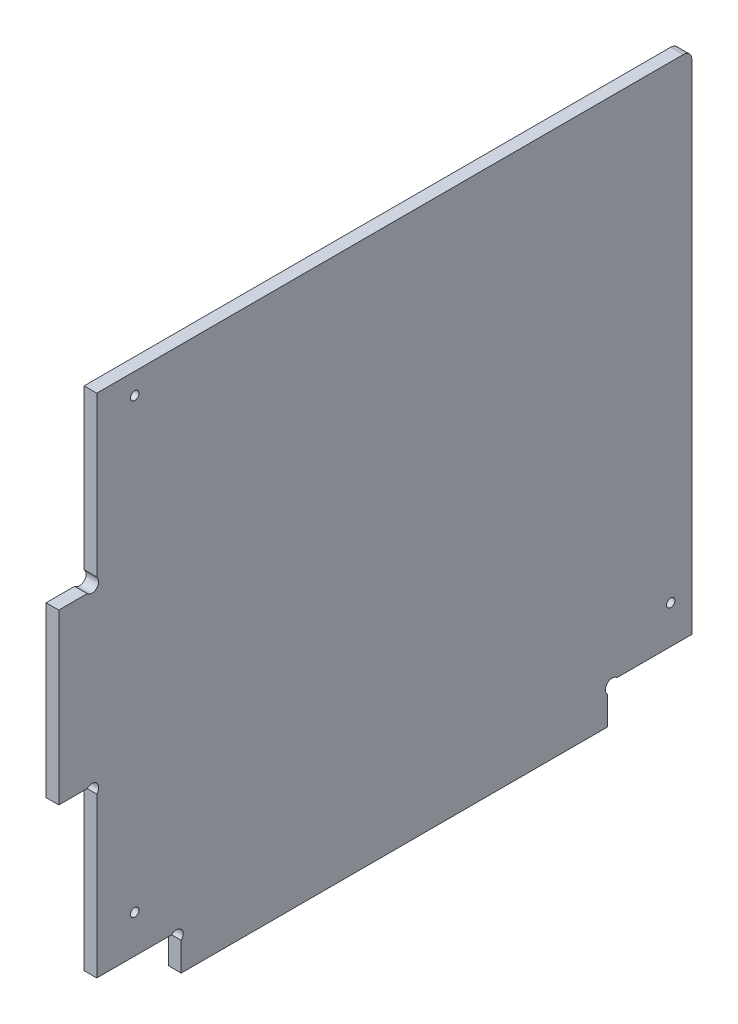
ISO-10303-21;
HEADER;
FILE_DESCRIPTION(('STEP AP214'),'2;1');
FILE_NAME('part.step','',(''),(''),'','','');
FILE_SCHEMA(('AUTOMOTIVE_DESIGN { 1 0 10303 214 1 1 1 1 }'));
ENDSEC;
DATA;
#1=APPLICATION_CONTEXT('core data for automotive mechanical design processes');
#2=APPLICATION_PROTOCOL_DEFINITION('international standard','automotive_design',2000,#1);
#3=PRODUCT_CONTEXT('',#1,'mechanical');
#4=PRODUCT('Part','Part','',(#3));
#5=PRODUCT_RELATED_PRODUCT_CATEGORY('part','',(#4));
#6=PRODUCT_DEFINITION_FORMATION('','',#4);
#7=PRODUCT_DEFINITION_CONTEXT('part definition',#1,'design');
#8=PRODUCT_DEFINITION('design','',#6,#7);
#9=PRODUCT_DEFINITION_SHAPE('','',#8);
#10=(LENGTH_UNIT() NAMED_UNIT(*) SI_UNIT(.MILLI.,.METRE.));
#11=(NAMED_UNIT(*) PLANE_ANGLE_UNIT() SI_UNIT($,.RADIAN.));
#12=(NAMED_UNIT(*) SI_UNIT($,.STERADIAN.) SOLID_ANGLE_UNIT());
#13=UNCERTAINTY_MEASURE_WITH_UNIT(LENGTH_MEASURE(1.E-05),#10,'distance_accuracy_value','');
#14=(GEOMETRIC_REPRESENTATION_CONTEXT(3) GLOBAL_UNCERTAINTY_ASSIGNED_CONTEXT((#13)) GLOBAL_UNIT_ASSIGNED_CONTEXT((#10,
#11,#12)) REPRESENTATION_CONTEXT('',''));
#15=CARTESIAN_POINT('',(0.,0.,0.));
#16=DIRECTION('',(0.,0.,1.));
#17=DIRECTION('',(1.,0.,0.));
#18=AXIS2_PLACEMENT_3D('',#15,#16,#17);
#19=CARTESIAN_POINT('',(3.,7.8686291501015,-131.131370849898));
#20=DIRECTION('',(-1.,0.,0.));
#21=DIRECTION('',(0.,0.,1.));
#22=AXIS2_PLACEMENT_3D('',#19,#20,#21);
#23=CYLINDRICAL_SURFACE('',#22,1.6);
#24=CARTESIAN_POINT('',(0.,7.8686291501015,-131.131370849898));
#25=DIRECTION('',(-1.,0.,0.));
#26=DIRECTION('',(0.,0.,-1.));
#27=AXIS2_PLACEMENT_3D('',#24,#25,#26);
#28=CIRCLE('',#27,1.6);
#29=CARTESIAN_POINT('',(0.,6.73725830020302,-130.));
#30=VERTEX_POINT('',#29);
#31=CARTESIAN_POINT('',(0.,9.,-132.262741699797));
#32=VERTEX_POINT('',#31);
#33=EDGE_CURVE('E176',#30,#32,#28,.T.);
#34=ORIENTED_EDGE('',*,*,#33,.T.);
#35=DIRECTION('',(-1.,0.,0.));
#36=VECTOR('',#35,1.);
#37=CARTESIAN_POINT('',(3.,9.,-132.262741699797));
#38=LINE('',#37,#36);
#39=CARTESIAN_POINT('',(3.,9.,-132.262741699797));
#40=VERTEX_POINT('',#39);
#41=EDGE_CURVE('E158',#40,#32,#38,.T.);
#42=ORIENTED_EDGE('',*,*,#41,.F.);
#43=CARTESIAN_POINT('',(3.,7.8686291501015,-131.131370849898));
#44=DIRECTION('',(-1.,0.,0.));
#45=DIRECTION('',(0.,0.,-1.));
#46=AXIS2_PLACEMENT_3D('',#43,#44,#45);
#47=CIRCLE('',#46,1.6);
#48=CARTESIAN_POINT('',(3.,6.73725830020302,-130.));
#49=VERTEX_POINT('',#48);
#50=EDGE_CURVE('E164',#49,#40,#47,.T.);
#51=ORIENTED_EDGE('',*,*,#50,.F.);
#52=DIRECTION('',(-1.,0.,0.));
#53=VECTOR('',#52,1.);
#54=CARTESIAN_POINT('',(3.,6.73725830020302,-130.));
#55=LINE('',#54,#53);
#56=EDGE_CURVE('E220',#49,#30,#55,.T.);
#57=ORIENTED_EDGE('',*,*,#56,.T.);
#58=EDGE_LOOP('',(#34,#42,#51,#57));
#59=FACE_BOUND('',#58,.T.);
#60=ADVANCED_FACE('F35',(#59),#23,.F.);
#61=CARTESIAN_POINT('',(3.,8.99999999999999,-150.));
#62=DIRECTION('',(0.,1.,0.));
#63=DIRECTION('',(0.,0.,1.));
#64=AXIS2_PLACEMENT_3D('',#61,#62,#63);
#65=PLANE('',#64);
#66=DIRECTION('',(0.,0.,-1.));
#67=VECTOR('',#66,1.);
#68=CARTESIAN_POINT('',(0.,8.99999999999999,-150.));
#69=LINE('',#68,#67);
#70=CARTESIAN_POINT('',(0.,8.99999999999999,-150.));
#71=VERTEX_POINT('',#70);
#72=EDGE_CURVE('E249',#32,#71,#69,.T.);
#73=ORIENTED_EDGE('',*,*,#72,.T.);
#74=DIRECTION('',(-1.,0.,0.));
#75=VECTOR('',#74,1.);
#76=CARTESIAN_POINT('',(3.,8.99999999999999,-150.));
#77=LINE('',#76,#75);
#78=CARTESIAN_POINT('',(3.,8.99999999999999,-150.));
#79=VERTEX_POINT('',#78);
#80=EDGE_CURVE('E161',#79,#71,#77,.T.);
#81=ORIENTED_EDGE('',*,*,#80,.F.);
#82=DIRECTION('',(0.,0.,-1.));
#83=VECTOR('',#82,1.);
#84=CARTESIAN_POINT('',(3.,8.99999999999999,-150.));
#85=LINE('',#84,#83);
#86=EDGE_CURVE('E154',#40,#79,#85,.T.);
#87=ORIENTED_EDGE('',*,*,#86,.F.);
#88=ORIENTED_EDGE('',*,*,#41,.T.);
#89=EDGE_LOOP('',(#73,#81,#87,#88));
#90=FACE_BOUND('',#89,.T.);
#91=ADVANCED_FACE('F156',(#90),#65,.F.);
#92=CARTESIAN_POINT('',(3.,129.,-150.));
#93=DIRECTION('',(0.,0.,1.));
#94=DIRECTION('',(0.,-1.,0.));
#95=AXIS2_PLACEMENT_3D('',#92,#93,#94);
#96=PLANE('',#95);
#97=DIRECTION('',(0.,1.,0.));
#98=VECTOR('',#97,1.);
#99=CARTESIAN_POINT('',(0.,129.,-150.));
#100=LINE('',#99,#98);
#101=CARTESIAN_POINT('',(0.,127.,-150.));
#102=VERTEX_POINT('',#101);
#103=EDGE_CURVE('E247',#71,#102,#100,.T.);
#104=ORIENTED_EDGE('',*,*,#103,.T.);
#105=DIRECTION('',(-1.,0.,0.));
#106=VECTOR('',#105,1.);
#107=CARTESIAN_POINT('',(3.,127.,-150.));
#108=LINE('',#107,#106);
#109=CARTESIAN_POINT('',(3.,127.,-150.));
#110=VERTEX_POINT('',#109);
#111=EDGE_CURVE('E43',#102,#110,#108,.F.);
#112=ORIENTED_EDGE('',*,*,#111,.T.);
#113=DIRECTION('',(0.,1.,0.));
#114=VECTOR('',#113,1.);
#115=CARTESIAN_POINT('',(3.,129.,-150.));
#116=LINE('',#115,#114);
#117=EDGE_CURVE('E163',#79,#110,#116,.T.);
#118=ORIENTED_EDGE('',*,*,#117,.F.);
#119=ORIENTED_EDGE('',*,*,#80,.T.);
#120=EDGE_LOOP('',(#104,#112,#118,#119));
#121=FACE_BOUND('',#120,.T.);
#122=ADVANCED_FACE('F331',(#121),#96,.F.);
#123=CARTESIAN_POINT('',(3.,129.,-8.99999999999997));
#124=DIRECTION('',(0.,-1.,0.));
#125=DIRECTION('',(0.,0.,-1.));
#126=AXIS2_PLACEMENT_3D('',#123,#124,#125);
#127=PLANE('',#126);
#128=DIRECTION('',(0.,0.,1.));
#129=VECTOR('',#128,1.);
#130=CARTESIAN_POINT('',(3.,129.,-8.99999999999997));
#131=LINE('',#130,#129);
#132=CARTESIAN_POINT('',(3.,129.,-148.));
#133=VERTEX_POINT('',#132);
#134=CARTESIAN_POINT('',(3.,129.,-8.99999999999997));
#135=VERTEX_POINT('',#134);
#136=EDGE_CURVE('E276',#133,#135,#131,.T.);
#137=ORIENTED_EDGE('',*,*,#136,.F.);
#138=DIRECTION('',(-1.,0.,0.));
#139=VECTOR('',#138,1.);
#140=CARTESIAN_POINT('',(3.,129.,-148.));
#141=LINE('',#140,#139);
#142=CARTESIAN_POINT('',(0.,129.,-148.));
#143=VERTEX_POINT('',#142);
#144=EDGE_CURVE('E177',#133,#143,#141,.T.);
#145=ORIENTED_EDGE('',*,*,#144,.T.);
#146=DIRECTION('',(0.,0.,1.));
#147=VECTOR('',#146,1.);
#148=CARTESIAN_POINT('',(0.,129.,-8.99999999999997));
#149=LINE('',#148,#147);
#150=CARTESIAN_POINT('',(0.,129.,-8.99999999999997));
#151=VERTEX_POINT('',#150);
#152=EDGE_CURVE('E245',#143,#151,#149,.T.);
#153=ORIENTED_EDGE('',*,*,#152,.T.);
#154=DIRECTION('',(-1.,0.,0.));
#155=VECTOR('',#154,1.);
#156=CARTESIAN_POINT('',(3.,129.,-8.99999999999997));
#157=LINE('',#156,#155);
#158=EDGE_CURVE('E181',#135,#151,#157,.T.);
#159=ORIENTED_EDGE('',*,*,#158,.F.);
#160=EDGE_LOOP('',(#137,#145,#153,#159));
#161=FACE_BOUND('',#160,.T.);
#162=ADVANCED_FACE('F336',(#161),#127,.F.);
#163=CARTESIAN_POINT('',(3.,91.2627416997969,-8.99999999999998));
#164=DIRECTION('',(0.,0.,-1.));
#165=DIRECTION('',(0.,1.,0.));
#166=AXIS2_PLACEMENT_3D('',#163,#164,#165);
#167=PLANE('',#166);
#168=DIRECTION('',(0.,-1.,0.));
#169=VECTOR('',#168,1.);
#170=CARTESIAN_POINT('',(0.,91.2627416997969,-8.99999999999998));
#171=LINE('',#170,#169);
#172=CARTESIAN_POINT('',(0.,91.2627416997969,-8.99999999999998));
#173=VERTEX_POINT('',#172);
#174=EDGE_CURVE('E243',#151,#173,#171,.T.);
#175=ORIENTED_EDGE('',*,*,#174,.T.);
#176=DIRECTION('',(-1.,0.,0.));
#177=VECTOR('',#176,1.);
#178=CARTESIAN_POINT('',(3.,91.2627416997969,-8.99999999999998));
#179=LINE('',#178,#177);
#180=CARTESIAN_POINT('',(3.,91.2627416997969,-8.99999999999998));
#181=VERTEX_POINT('',#180);
#182=EDGE_CURVE('E187',#181,#173,#179,.T.);
#183=ORIENTED_EDGE('',*,*,#182,.F.);
#184=DIRECTION('',(0.,-1.,0.));
#185=VECTOR('',#184,1.);
#186=CARTESIAN_POINT('',(3.,91.2627416997969,-8.99999999999998));
#187=LINE('',#186,#185);
#188=EDGE_CURVE('E274',#135,#181,#187,.T.);
#189=ORIENTED_EDGE('',*,*,#188,.F.);
#190=ORIENTED_EDGE('',*,*,#158,.T.);
#191=EDGE_LOOP('',(#175,#183,#189,#190));
#192=FACE_BOUND('',#191,.T.);
#193=ADVANCED_FACE('F339',(#192),#167,.F.);
#194=CARTESIAN_POINT('',(3.,90.1313708498985,-7.86862915010151));
#195=DIRECTION('',(-1.,0.,0.));
#196=DIRECTION('',(0.,0.,1.));
#197=AXIS2_PLACEMENT_3D('',#194,#195,#196);
#198=CYLINDRICAL_SURFACE('',#197,1.6);
#199=CARTESIAN_POINT('',(0.,90.1313708498985,-7.86862915010151));
#200=DIRECTION('',(-1.,0.,0.));
#201=DIRECTION('',(0.,0.,1.));
#202=AXIS2_PLACEMENT_3D('',#199,#200,#201);
#203=CIRCLE('',#202,1.6);
#204=CARTESIAN_POINT('',(0.,89.,-6.73725830020303));
#205=VERTEX_POINT('',#204);
#206=EDGE_CURVE('E241',#173,#205,#203,.T.);
#207=ORIENTED_EDGE('',*,*,#206,.T.);
#208=DIRECTION('',(-1.,0.,0.));
#209=VECTOR('',#208,1.);
#210=CARTESIAN_POINT('',(3.,89.,-6.73725830020303));
#211=LINE('',#210,#209);
#212=CARTESIAN_POINT('',(3.,89.,-6.73725830020303));
#213=VERTEX_POINT('',#212);
#214=EDGE_CURVE('E190',#213,#205,#211,.T.);
#215=ORIENTED_EDGE('',*,*,#214,.F.);
#216=CARTESIAN_POINT('',(3.,90.1313708498985,-7.86862915010151));
#217=DIRECTION('',(-1.,0.,0.));
#218=DIRECTION('',(0.,0.,1.));
#219=AXIS2_PLACEMENT_3D('',#216,#217,#218);
#220=CIRCLE('',#219,1.6);
#221=EDGE_CURVE('E272',#181,#213,#220,.T.);
#222=ORIENTED_EDGE('',*,*,#221,.F.);
#223=ORIENTED_EDGE('',*,*,#182,.T.);
#224=EDGE_LOOP('',(#207,#215,#222,#223));
#225=FACE_BOUND('',#224,.T.);
#226=ADVANCED_FACE('F343',(#225),#198,.F.);
#227=CARTESIAN_POINT('',(3.,89.,0.));
#228=DIRECTION('',(0.,-1.,0.));
#229=DIRECTION('',(0.,0.,-1.));
#230=AXIS2_PLACEMENT_3D('',#227,#228,#229);
#231=PLANE('',#230);
#232=DIRECTION('',(0.,0.,1.));
#233=VECTOR('',#232,1.);
#234=CARTESIAN_POINT('',(0.,89.,0.));
#235=LINE('',#234,#233);
#236=CARTESIAN_POINT('',(0.,89.,0.));
#237=VERTEX_POINT('',#236);
#238=EDGE_CURVE('E239',#205,#237,#235,.T.);
#239=ORIENTED_EDGE('',*,*,#238,.T.);
#240=DIRECTION('',(-1.,0.,0.));
#241=VECTOR('',#240,1.);
#242=CARTESIAN_POINT('',(3.,89.,0.));
#243=LINE('',#242,#241);
#244=CARTESIAN_POINT('',(3.,89.,0.));
#245=VERTEX_POINT('',#244);
#246=EDGE_CURVE('E193',#245,#237,#243,.T.);
#247=ORIENTED_EDGE('',*,*,#246,.F.);
#248=DIRECTION('',(0.,0.,1.));
#249=VECTOR('',#248,1.);
#250=CARTESIAN_POINT('',(3.,89.,0.));
#251=LINE('',#250,#249);
#252=EDGE_CURVE('E270',#213,#245,#251,.T.);
#253=ORIENTED_EDGE('',*,*,#252,.F.);
#254=ORIENTED_EDGE('',*,*,#214,.T.);
#255=EDGE_LOOP('',(#239,#247,#253,#254));
#256=FACE_BOUND('',#255,.T.);
#257=ADVANCED_FACE('F347',(#256),#231,.F.);
#258=CARTESIAN_POINT('',(3.,49.,0.));
#259=DIRECTION('',(0.,0.,-1.));
#260=DIRECTION('',(-1.,0.,0.));
#261=AXIS2_PLACEMENT_3D('',#258,#259,#260);
#262=PLANE('',#261);
#263=DIRECTION('',(0.,-1.,0.));
#264=VECTOR('',#263,1.);
#265=CARTESIAN_POINT('',(0.,49.,0.));
#266=LINE('',#265,#264);
#267=CARTESIAN_POINT('',(0.,49.,0.));
#268=VERTEX_POINT('',#267);
#269=EDGE_CURVE('E237',#237,#268,#266,.T.);
#270=ORIENTED_EDGE('',*,*,#269,.T.);
#271=DIRECTION('',(-1.,0.,0.));
#272=VECTOR('',#271,1.);
#273=CARTESIAN_POINT('',(3.,49.,0.));
#274=LINE('',#273,#272);
#275=CARTESIAN_POINT('',(3.,49.,0.));
#276=VERTEX_POINT('',#275);
#277=EDGE_CURVE('E196',#276,#268,#274,.T.);
#278=ORIENTED_EDGE('',*,*,#277,.F.);
#279=DIRECTION('',(0.,-1.,0.));
#280=VECTOR('',#279,1.);
#281=CARTESIAN_POINT('',(3.,49.,0.));
#282=LINE('',#281,#280);
#283=EDGE_CURVE('E268',#245,#276,#282,.T.);
#284=ORIENTED_EDGE('',*,*,#283,.F.);
#285=ORIENTED_EDGE('',*,*,#246,.T.);
#286=EDGE_LOOP('',(#270,#278,#284,#285));
#287=FACE_BOUND('',#286,.T.);
#288=ADVANCED_FACE('F351',(#287),#262,.F.);
#289=CARTESIAN_POINT('',(3.,49.,0.));
#290=DIRECTION('',(0.,1.,0.));
#291=DIRECTION('',(0.,0.,1.));
#292=AXIS2_PLACEMENT_3D('',#289,#290,#291);
#293=PLANE('',#292);
#294=DIRECTION('',(0.,0.,-1.));
#295=VECTOR('',#294,1.);
#296=CARTESIAN_POINT('',(0.,49.,0.));
#297=LINE('',#296,#295);
#298=CARTESIAN_POINT('',(0.,49.,-6.73725830020302));
#299=VERTEX_POINT('',#298);
#300=EDGE_CURVE('E235',#268,#299,#297,.T.);
#301=ORIENTED_EDGE('',*,*,#300,.T.);
#302=DIRECTION('',(-1.,0.,0.));
#303=VECTOR('',#302,1.);
#304=CARTESIAN_POINT('',(3.,49.,-6.73725830020302));
#305=LINE('',#304,#303);
#306=CARTESIAN_POINT('',(3.,49.,-6.73725830020302));
#307=VERTEX_POINT('',#306);
#308=EDGE_CURVE('E199',#307,#299,#305,.T.);
#309=ORIENTED_EDGE('',*,*,#308,.F.);
#310=DIRECTION('',(0.,0.,-1.));
#311=VECTOR('',#310,1.);
#312=CARTESIAN_POINT('',(3.,49.,0.));
#313=LINE('',#312,#311);
#314=EDGE_CURVE('E266',#276,#307,#313,.T.);
#315=ORIENTED_EDGE('',*,*,#314,.F.);
#316=ORIENTED_EDGE('',*,*,#277,.T.);
#317=EDGE_LOOP('',(#301,#309,#315,#316));
#318=FACE_BOUND('',#317,.T.);
#319=ADVANCED_FACE('F355',(#318),#293,.F.);
#320=CARTESIAN_POINT('',(3.,47.8686291501015,-7.86862915010151));
#321=DIRECTION('',(-1.,0.,0.));
#322=DIRECTION('',(0.,0.,1.));
#323=AXIS2_PLACEMENT_3D('',#320,#321,#322);
#324=CYLINDRICAL_SURFACE('',#323,1.6);
#325=CARTESIAN_POINT('',(0.,47.8686291501015,-7.86862915010151));
#326=DIRECTION('',(-1.,0.,0.));
#327=DIRECTION('',(0.,0.,-1.));
#328=AXIS2_PLACEMENT_3D('',#325,#326,#327);
#329=CIRCLE('',#328,1.6);
#330=CARTESIAN_POINT('',(0.,46.7372583002031,-8.99999999999999));
#331=VERTEX_POINT('',#330);
#332=EDGE_CURVE('E233',#299,#331,#329,.T.);
#333=ORIENTED_EDGE('',*,*,#332,.T.);
#334=DIRECTION('',(-1.,0.,0.));
#335=VECTOR('',#334,1.);
#336=CARTESIAN_POINT('',(3.,46.7372583002031,-8.99999999999999));
#337=LINE('',#336,#335);
#338=CARTESIAN_POINT('',(3.,46.7372583002031,-8.99999999999999));
#339=VERTEX_POINT('',#338);
#340=EDGE_CURVE('E202',#339,#331,#337,.T.);
#341=ORIENTED_EDGE('',*,*,#340,.F.);
#342=CARTESIAN_POINT('',(3.,47.8686291501015,-7.86862915010151));
#343=DIRECTION('',(-1.,0.,0.));
#344=DIRECTION('',(0.,0.,-1.));
#345=AXIS2_PLACEMENT_3D('',#342,#343,#344);
#346=CIRCLE('',#345,1.6);
#347=EDGE_CURVE('E264',#307,#339,#346,.T.);
#348=ORIENTED_EDGE('',*,*,#347,.F.);
#349=ORIENTED_EDGE('',*,*,#308,.T.);
#350=EDGE_LOOP('',(#333,#341,#348,#349));
#351=FACE_BOUND('',#350,.T.);
#352=ADVANCED_FACE('F359',(#351),#324,.F.);
#353=CARTESIAN_POINT('',(3.,8.99999999999998,-9.));
#354=DIRECTION('',(0.,0.,-1.));
#355=DIRECTION('',(0.,1.,0.));
#356=AXIS2_PLACEMENT_3D('',#353,#354,#355);
#357=PLANE('',#356);
#358=DIRECTION('',(0.,-1.,0.));
#359=VECTOR('',#358,1.);
#360=CARTESIAN_POINT('',(0.,8.99999999999998,-9.));
#361=LINE('',#360,#359);
#362=CARTESIAN_POINT('',(0.,8.99999999999998,-9.));
#363=VERTEX_POINT('',#362);
#364=EDGE_CURVE('E231',#331,#363,#361,.T.);
#365=ORIENTED_EDGE('',*,*,#364,.T.);
#366=DIRECTION('',(-1.,0.,0.));
#367=VECTOR('',#366,1.);
#368=CARTESIAN_POINT('',(3.,8.99999999999998,-9.));
#369=LINE('',#368,#367);
#370=CARTESIAN_POINT('',(3.,8.99999999999998,-9.));
#371=VERTEX_POINT('',#370);
#372=EDGE_CURVE('E205',#371,#363,#369,.T.);
#373=ORIENTED_EDGE('',*,*,#372,.F.);
#374=DIRECTION('',(0.,-1.,0.));
#375=VECTOR('',#374,1.);
#376=CARTESIAN_POINT('',(3.,8.99999999999998,-9.));
#377=LINE('',#376,#375);
#378=EDGE_CURVE('E262',#339,#371,#377,.T.);
#379=ORIENTED_EDGE('',*,*,#378,.F.);
#380=ORIENTED_EDGE('',*,*,#340,.T.);
#381=EDGE_LOOP('',(#365,#373,#379,#380));
#382=FACE_BOUND('',#381,.T.);
#383=ADVANCED_FACE('F363',(#382),#357,.F.);
#384=CARTESIAN_POINT('',(3.,8.99999999999998,-26.737258300203));
#385=DIRECTION('',(0.,1.,0.));
#386=DIRECTION('',(0.,0.,1.));
#387=AXIS2_PLACEMENT_3D('',#384,#385,#386);
#388=PLANE('',#387);
#389=DIRECTION('',(0.,0.,-1.));
#390=VECTOR('',#389,1.);
#391=CARTESIAN_POINT('',(0.,8.99999999999998,-26.737258300203));
#392=LINE('',#391,#390);
#393=CARTESIAN_POINT('',(0.,8.99999999999998,-26.737258300203));
#394=VERTEX_POINT('',#393);
#395=EDGE_CURVE('E229',#363,#394,#392,.T.);
#396=ORIENTED_EDGE('',*,*,#395,.T.);
#397=DIRECTION('',(-1.,0.,0.));
#398=VECTOR('',#397,1.);
#399=CARTESIAN_POINT('',(3.,8.99999999999998,-26.737258300203));
#400=LINE('',#399,#398);
#401=CARTESIAN_POINT('',(3.,8.99999999999998,-26.737258300203));
#402=VERTEX_POINT('',#401);
#403=EDGE_CURVE('E208',#402,#394,#400,.T.);
#404=ORIENTED_EDGE('',*,*,#403,.F.);
#405=DIRECTION('',(0.,0.,-1.));
#406=VECTOR('',#405,1.);
#407=CARTESIAN_POINT('',(3.,8.99999999999998,-26.737258300203));
#408=LINE('',#407,#406);
#409=EDGE_CURVE('E260',#371,#402,#408,.T.);
#410=ORIENTED_EDGE('',*,*,#409,.F.);
#411=ORIENTED_EDGE('',*,*,#372,.T.);
#412=EDGE_LOOP('',(#396,#404,#410,#411));
#413=FACE_BOUND('',#412,.T.);
#414=ADVANCED_FACE('F367',(#413),#388,.F.);
#415=CARTESIAN_POINT('',(3.,7.8686291501015,-27.8686291501015));
#416=DIRECTION('',(-1.,0.,0.));
#417=DIRECTION('',(0.,0.,1.));
#418=AXIS2_PLACEMENT_3D('',#415,#416,#417);
#419=CYLINDRICAL_SURFACE('',#418,1.6);
#420=CARTESIAN_POINT('',(0.,7.8686291501015,-27.8686291501015));
#421=DIRECTION('',(-1.,0.,0.));
#422=DIRECTION('',(0.,0.,1.));
#423=AXIS2_PLACEMENT_3D('',#420,#421,#422);
#424=CIRCLE('',#423,1.6);
#425=CARTESIAN_POINT('',(0.,6.73725830020306,-29.));
#426=VERTEX_POINT('',#425);
#427=EDGE_CURVE('E227',#394,#426,#424,.T.);
#428=ORIENTED_EDGE('',*,*,#427,.T.);
#429=DIRECTION('',(-1.,0.,0.));
#430=VECTOR('',#429,1.);
#431=CARTESIAN_POINT('',(3.,6.73725830020306,-29.));
#432=LINE('',#431,#430);
#433=CARTESIAN_POINT('',(3.,6.73725830020306,-29.));
#434=VERTEX_POINT('',#433);
#435=EDGE_CURVE('E211',#434,#426,#432,.T.);
#436=ORIENTED_EDGE('',*,*,#435,.F.);
#437=CARTESIAN_POINT('',(3.,7.8686291501015,-27.8686291501015));
#438=DIRECTION('',(-1.,0.,0.));
#439=DIRECTION('',(0.,0.,1.));
#440=AXIS2_PLACEMENT_3D('',#437,#438,#439);
#441=CIRCLE('',#440,1.6);
#442=EDGE_CURVE('E258',#402,#434,#441,.T.);
#443=ORIENTED_EDGE('',*,*,#442,.F.);
#444=ORIENTED_EDGE('',*,*,#403,.T.);
#445=EDGE_LOOP('',(#428,#436,#443,#444));
#446=FACE_BOUND('',#445,.T.);
#447=ADVANCED_FACE('F371',(#446),#419,.F.);
#448=CARTESIAN_POINT('',(3.,6.73725830020306,-29.));
#449=DIRECTION('',(0.,0.,-1.));
#450=DIRECTION('',(0.,1.,0.));
#451=AXIS2_PLACEMENT_3D('',#448,#449,#450);
#452=PLANE('',#451);
#453=DIRECTION('',(0.,-1.,0.));
#454=VECTOR('',#453,1.);
#455=CARTESIAN_POINT('',(0.,6.73725830020306,-29.));
#456=LINE('',#455,#454);
#457=CARTESIAN_POINT('',(0.,0.,-29.));
#458=VERTEX_POINT('',#457);
#459=EDGE_CURVE('E225',#426,#458,#456,.T.);
#460=ORIENTED_EDGE('',*,*,#459,.T.);
#461=DIRECTION('',(-1.,0.,0.));
#462=VECTOR('',#461,1.);
#463=CARTESIAN_POINT('',(3.,0.,-29.));
#464=LINE('',#463,#462);
#465=CARTESIAN_POINT('',(3.,0.,-29.));
#466=VERTEX_POINT('',#465);
#467=EDGE_CURVE('E214',#466,#458,#464,.T.);
#468=ORIENTED_EDGE('',*,*,#467,.F.);
#469=DIRECTION('',(0.,-1.,0.));
#470=VECTOR('',#469,1.);
#471=CARTESIAN_POINT('',(3.,6.73725830020306,-29.));
#472=LINE('',#471,#470);
#473=EDGE_CURVE('E256',#434,#466,#472,.T.);
#474=ORIENTED_EDGE('',*,*,#473,.F.);
#475=ORIENTED_EDGE('',*,*,#435,.T.);
#476=EDGE_LOOP('',(#460,#468,#474,#475));
#477=FACE_BOUND('',#476,.T.);
#478=ADVANCED_FACE('F375',(#477),#452,.F.);
#479=CARTESIAN_POINT('',(3.,0.,-29.));
#480=DIRECTION('',(0.,1.,0.));
#481=DIRECTION('',(0.,0.,1.));
#482=AXIS2_PLACEMENT_3D('',#479,#480,#481);
#483=PLANE('',#482);
#484=DIRECTION('',(0.,0.,-1.));
#485=VECTOR('',#484,1.);
#486=CARTESIAN_POINT('',(0.,0.,-29.));
#487=LINE('',#486,#485);
#488=CARTESIAN_POINT('',(0.,0.,-130.));
#489=VERTEX_POINT('',#488);
#490=EDGE_CURVE('E223',#458,#489,#487,.T.);
#491=ORIENTED_EDGE('',*,*,#490,.T.);
#492=DIRECTION('',(-1.,0.,0.));
#493=VECTOR('',#492,1.);
#494=CARTESIAN_POINT('',(3.,0.,-130.));
#495=LINE('',#494,#493);
#496=CARTESIAN_POINT('',(3.,0.,-130.));
#497=VERTEX_POINT('',#496);
#498=EDGE_CURVE('E217',#497,#489,#495,.T.);
#499=ORIENTED_EDGE('',*,*,#498,.F.);
#500=DIRECTION('',(0.,0.,-1.));
#501=VECTOR('',#500,1.);
#502=CARTESIAN_POINT('',(3.,0.,-29.));
#503=LINE('',#502,#501);
#504=EDGE_CURVE('E254',#466,#497,#503,.T.);
#505=ORIENTED_EDGE('',*,*,#504,.F.);
#506=ORIENTED_EDGE('',*,*,#467,.T.);
#507=EDGE_LOOP('',(#491,#499,#505,#506));
#508=FACE_BOUND('',#507,.T.);
#509=ADVANCED_FACE('F379',(#508),#483,.F.);
#510=CARTESIAN_POINT('',(3.,6.73725830020302,-130.));
#511=DIRECTION('',(0.,0.,1.));
#512=DIRECTION('',(0.,-1.,0.));
#513=AXIS2_PLACEMENT_3D('',#510,#511,#512);
#514=PLANE('',#513);
#515=DIRECTION('',(0.,1.,0.));
#516=VECTOR('',#515,1.);
#517=CARTESIAN_POINT('',(0.,6.73725830020302,-130.));
#518=LINE('',#517,#516);
#519=EDGE_CURVE('E173',#489,#30,#518,.T.);
#520=ORIENTED_EDGE('',*,*,#519,.T.);
#521=ORIENTED_EDGE('',*,*,#56,.F.);
#522=DIRECTION('',(0.,1.,0.));
#523=VECTOR('',#522,1.);
#524=CARTESIAN_POINT('',(3.,6.73725830020302,-130.));
#525=LINE('',#524,#523);
#526=EDGE_CURVE('E169',#497,#49,#525,.T.);
#527=ORIENTED_EDGE('',*,*,#526,.F.);
#528=ORIENTED_EDGE('',*,*,#498,.T.);
#529=EDGE_LOOP('',(#520,#521,#527,#528));
#530=FACE_BOUND('',#529,.T.);
#531=ADVANCED_FACE('F309',(#530),#514,.F.);
#532=CARTESIAN_POINT('',(3.,7.8686291501015,-131.131370849898));
#533=DIRECTION('',(1.,0.,0.));
#534=DIRECTION('',(0.,0.,-1.));
#535=AXIS2_PLACEMENT_3D('',#532,#533,#534);
#536=PLANE('',#535);
#537=CARTESIAN_POINT('',(3.,124.,-18.));
#538=DIRECTION('',(1.,0.,0.));
#539=DIRECTION('',(0.,0.,-1.));
#540=AXIS2_PLACEMENT_3D('',#537,#538,#539);
#541=CIRCLE('',#540,0.999999999999998);
#542=CARTESIAN_POINT('',(3.,124.,-19.));
#543=VERTEX_POINT('',#542);
#544=EDGE_CURVE('E291',#543,#543,#541,.T.);
#545=ORIENTED_EDGE('',*,*,#544,.F.);
#546=EDGE_LOOP('',(#545));
#547=FACE_BOUND('',#546,.T.);
#548=CARTESIAN_POINT('',(3.,18.,-18.));
#549=DIRECTION('',(1.,0.,0.));
#550=DIRECTION('',(0.,0.,-1.));
#551=AXIS2_PLACEMENT_3D('',#548,#549,#550);
#552=CIRCLE('',#551,1.00000000000001);
#553=CARTESIAN_POINT('',(3.,18.,-19.));
#554=VERTEX_POINT('',#553);
#555=EDGE_CURVE('E285',#554,#554,#552,.T.);
#556=ORIENTED_EDGE('',*,*,#555,.F.);
#557=EDGE_LOOP('',(#556));
#558=FACE_BOUND('',#557,.T.);
#559=CARTESIAN_POINT('',(3.,18.,-145.));
#560=DIRECTION('',(1.,0.,0.));
#561=DIRECTION('',(0.,0.,-1.));
#562=AXIS2_PLACEMENT_3D('',#559,#560,#561);
#563=CIRCLE('',#562,0.999999999999998);
#564=CARTESIAN_POINT('',(3.,18.,-146.));
#565=VERTEX_POINT('',#564);
#566=EDGE_CURVE('E279',#565,#565,#563,.T.);
#567=ORIENTED_EDGE('',*,*,#566,.F.);
#568=EDGE_LOOP('',(#567));
#569=FACE_BOUND('',#568,.T.);
#570=ORIENTED_EDGE('',*,*,#117,.T.);
#571=CARTESIAN_POINT('',(3.,127.,-148.));
#572=DIRECTION('',(1.,0.,0.));
#573=DIRECTION('',(0.,0.,-1.));
#574=AXIS2_PLACEMENT_3D('',#571,#572,#573);
#575=CIRCLE('',#574,2.);
#576=EDGE_CURVE('E11',#110,#133,#575,.T.);
#577=ORIENTED_EDGE('',*,*,#576,.T.);
#578=ORIENTED_EDGE('',*,*,#136,.T.);
#579=ORIENTED_EDGE('',*,*,#188,.T.);
#580=ORIENTED_EDGE('',*,*,#221,.T.);
#581=ORIENTED_EDGE('',*,*,#252,.T.);
#582=ORIENTED_EDGE('',*,*,#283,.T.);
#583=ORIENTED_EDGE('',*,*,#314,.T.);
#584=ORIENTED_EDGE('',*,*,#347,.T.);
#585=ORIENTED_EDGE('',*,*,#378,.T.);
#586=ORIENTED_EDGE('',*,*,#409,.T.);
#587=ORIENTED_EDGE('',*,*,#442,.T.);
#588=ORIENTED_EDGE('',*,*,#473,.T.);
#589=ORIENTED_EDGE('',*,*,#504,.T.);
#590=ORIENTED_EDGE('',*,*,#526,.T.);
#591=ORIENTED_EDGE('',*,*,#50,.T.);
#592=ORIENTED_EDGE('',*,*,#86,.T.);
#593=EDGE_LOOP('',(#570,#577,#578,#579,#580,#581,#582,#583,#584,#585,#586,#587,#588,#589,#590,
#591,#592));
#594=FACE_BOUND('',#593,.T.);
#595=ADVANCED_FACE('F167',(#547,#558,#569,#594),#536,.T.);
#596=CARTESIAN_POINT('',(0.,7.8686291501015,-131.131370849898));
#597=DIRECTION('',(1.,0.,0.));
#598=DIRECTION('',(0.,0.,-1.));
#599=AXIS2_PLACEMENT_3D('',#596,#597,#598);
#600=PLANE('',#599);
#601=CARTESIAN_POINT('',(0.,124.,-18.));
#602=DIRECTION('',(1.,0.,0.));
#603=DIRECTION('',(0.,0.,-1.));
#604=AXIS2_PLACEMENT_3D('',#601,#602,#603);
#605=CIRCLE('',#604,0.999999999999998);
#606=CARTESIAN_POINT('',(0.,124.,-19.));
#607=VERTEX_POINT('',#606);
#608=EDGE_CURVE('E252',#607,#607,#605,.T.);
#609=ORIENTED_EDGE('',*,*,#608,.T.);
#610=EDGE_LOOP('',(#609));
#611=FACE_BOUND('',#610,.T.);
#612=CARTESIAN_POINT('',(0.,18.,-18.));
#613=DIRECTION('',(1.,0.,0.));
#614=DIRECTION('',(0.,0.,-1.));
#615=AXIS2_PLACEMENT_3D('',#612,#613,#614);
#616=CIRCLE('',#615,1.00000000000001);
#617=CARTESIAN_POINT('',(0.,18.,-19.));
#618=VERTEX_POINT('',#617);
#619=EDGE_CURVE('E288',#618,#618,#616,.T.);
#620=ORIENTED_EDGE('',*,*,#619,.T.);
#621=EDGE_LOOP('',(#620));
#622=FACE_BOUND('',#621,.T.);
#623=CARTESIAN_POINT('',(0.,18.,-145.));
#624=DIRECTION('',(1.,0.,0.));
#625=DIRECTION('',(0.,0.,-1.));
#626=AXIS2_PLACEMENT_3D('',#623,#624,#625);
#627=CIRCLE('',#626,0.999999999999998);
#628=CARTESIAN_POINT('',(0.,18.,-146.));
#629=VERTEX_POINT('',#628);
#630=EDGE_CURVE('E282',#629,#629,#627,.T.);
#631=ORIENTED_EDGE('',*,*,#630,.T.);
#632=EDGE_LOOP('',(#631));
#633=FACE_BOUND('',#632,.T.);
#634=ORIENTED_EDGE('',*,*,#152,.F.);
#635=CARTESIAN_POINT('',(0.,127.,-148.));
#636=DIRECTION('',(1.,0.,0.));
#637=DIRECTION('',(0.,0.,-1.));
#638=AXIS2_PLACEMENT_3D('',#635,#636,#637);
#639=CIRCLE('',#638,2.);
#640=EDGE_CURVE('E57',#143,#102,#639,.F.);
#641=ORIENTED_EDGE('',*,*,#640,.T.);
#642=ORIENTED_EDGE('',*,*,#103,.F.);
#643=ORIENTED_EDGE('',*,*,#72,.F.);
#644=ORIENTED_EDGE('',*,*,#33,.F.);
#645=ORIENTED_EDGE('',*,*,#519,.F.);
#646=ORIENTED_EDGE('',*,*,#490,.F.);
#647=ORIENTED_EDGE('',*,*,#459,.F.);
#648=ORIENTED_EDGE('',*,*,#427,.F.);
#649=ORIENTED_EDGE('',*,*,#395,.F.);
#650=ORIENTED_EDGE('',*,*,#364,.F.);
#651=ORIENTED_EDGE('',*,*,#332,.F.);
#652=ORIENTED_EDGE('',*,*,#300,.F.);
#653=ORIENTED_EDGE('',*,*,#269,.F.);
#654=ORIENTED_EDGE('',*,*,#238,.F.);
#655=ORIENTED_EDGE('',*,*,#206,.F.);
#656=ORIENTED_EDGE('',*,*,#174,.F.);
#657=EDGE_LOOP('',(#634,#641,#642,#643,#644,#645,#646,#647,#648,#649,#650,#651,#652,#653,#654,
#655,#656));
#658=FACE_BOUND('',#657,.T.);
#659=ADVANCED_FACE('F297',(#611,#622,#633,#658),#600,.F.);
#660=CARTESIAN_POINT('',(0.,18.,-145.));
#661=DIRECTION('',(1.,0.,0.));
#662=DIRECTION('',(0.,0.,-1.));
#663=AXIS2_PLACEMENT_3D('',#660,#661,#662);
#664=CYLINDRICAL_SURFACE('',#663,0.999999999999998);
#665=ORIENTED_EDGE('',*,*,#630,.F.);
#666=EDGE_LOOP('',(#665));
#667=FACE_BOUND('',#666,.T.);
#668=ORIENTED_EDGE('',*,*,#566,.T.);
#669=EDGE_LOOP('',(#668));
#670=FACE_BOUND('',#669,.T.);
#671=ADVANCED_FACE('F315',(#667,#670),#664,.F.);
#672=CARTESIAN_POINT('',(0.,18.,-18.));
#673=DIRECTION('',(1.,0.,0.));
#674=DIRECTION('',(0.,0.,-1.));
#675=AXIS2_PLACEMENT_3D('',#672,#673,#674);
#676=CYLINDRICAL_SURFACE('',#675,1.00000000000001);
#677=ORIENTED_EDGE('',*,*,#619,.F.);
#678=EDGE_LOOP('',(#677));
#679=FACE_BOUND('',#678,.T.);
#680=ORIENTED_EDGE('',*,*,#555,.T.);
#681=EDGE_LOOP('',(#680));
#682=FACE_BOUND('',#681,.T.);
#683=ADVANCED_FACE('F303',(#679,#682),#676,.F.);
#684=CARTESIAN_POINT('',(0.,124.,-18.));
#685=DIRECTION('',(1.,0.,0.));
#686=DIRECTION('',(0.,0.,-1.));
#687=AXIS2_PLACEMENT_3D('',#684,#685,#686);
#688=CYLINDRICAL_SURFACE('',#687,0.999999999999998);
#689=ORIENTED_EDGE('',*,*,#608,.F.);
#690=EDGE_LOOP('',(#689));
#691=FACE_BOUND('',#690,.T.);
#692=ORIENTED_EDGE('',*,*,#544,.T.);
#693=EDGE_LOOP('',(#692));
#694=FACE_BOUND('',#693,.T.);
#695=ADVANCED_FACE('F300',(#691,#694),#688,.F.);
#696=CARTESIAN_POINT('',(3.,127.,-148.));
#697=DIRECTION('',(-1.,0.,0.));
#698=DIRECTION('',(0.,0.,1.));
#699=AXIS2_PLACEMENT_3D('',#696,#697,#698);
#700=CYLINDRICAL_SURFACE('',#699,2.);
#701=ORIENTED_EDGE('',*,*,#576,.F.);
#702=ORIENTED_EDGE('',*,*,#111,.F.);
#703=ORIENTED_EDGE('',*,*,#640,.F.);
#704=ORIENTED_EDGE('',*,*,#144,.F.);
#705=EDGE_LOOP('',(#701,#702,#703,#704));
#706=FACE_BOUND('',#705,.T.);
#707=ADVANCED_FACE('F37',(#706),#700,.T.);
#708=CLOSED_SHELL('',(#60,#91,#122,#162,#193,#226,#257,#288,#319,#352,#383,#414,#447,#478,#509,
#531,#595,#659,#671,#683,#695,#707));
#709=MANIFOLD_SOLID_BREP('B2',#708);
#710=ADVANCED_BREP_SHAPE_REPRESENTATION('',(#18,#709),#14);
#711=SHAPE_DEFINITION_REPRESENTATION(#9,#710);
ENDSEC;
END-ISO-10303-21;
